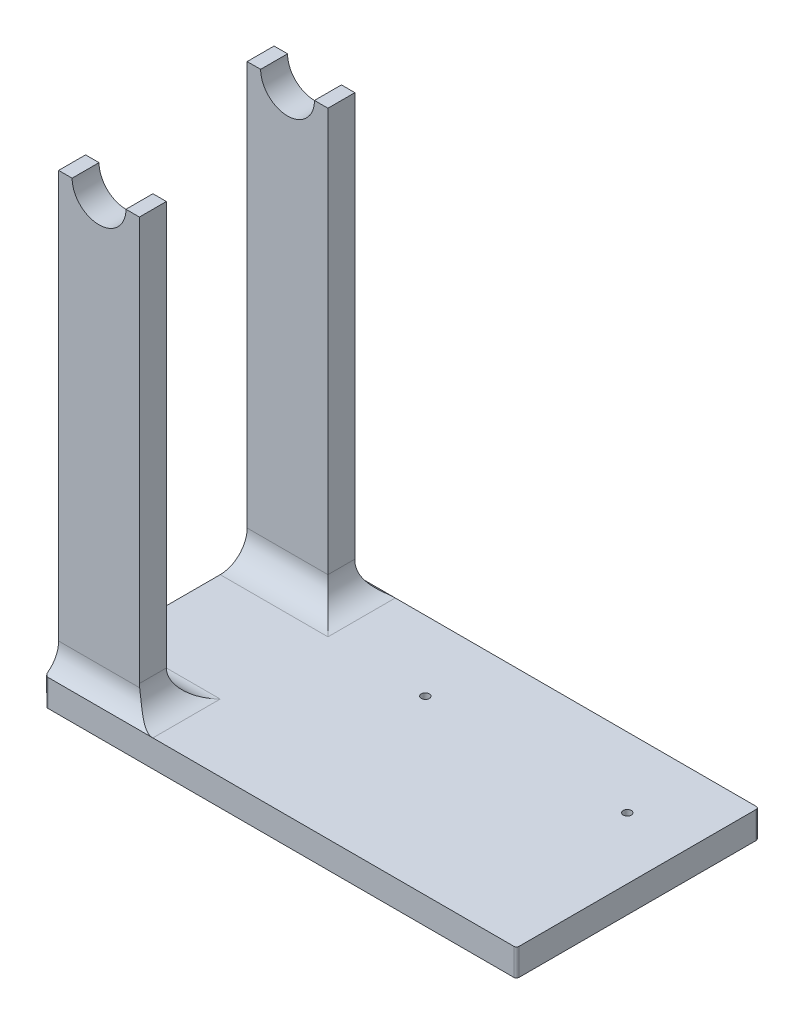
ISO-10303-21;
HEADER;
FILE_DESCRIPTION(('STEP AP214'),'2;1');
FILE_NAME('part.step','',(''),(''),'','','');
FILE_SCHEMA(('AUTOMOTIVE_DESIGN { 1 0 10303 214 1 1 1 1 }'));
ENDSEC;
DATA;
#1=APPLICATION_CONTEXT('core data for automotive mechanical design processes');
#2=APPLICATION_PROTOCOL_DEFINITION('international standard','automotive_design',2000,#1);
#3=PRODUCT_CONTEXT('',#1,'mechanical');
#4=PRODUCT('Part','Part','',(#3));
#5=PRODUCT_RELATED_PRODUCT_CATEGORY('part','',(#4));
#6=PRODUCT_DEFINITION_FORMATION('','',#4);
#7=PRODUCT_DEFINITION_CONTEXT('part definition',#1,'design');
#8=PRODUCT_DEFINITION('design','',#6,#7);
#9=PRODUCT_DEFINITION_SHAPE('','',#8);
#10=(LENGTH_UNIT() NAMED_UNIT(*) SI_UNIT(.MILLI.,.METRE.));
#11=(NAMED_UNIT(*) PLANE_ANGLE_UNIT() SI_UNIT($,.RADIAN.));
#12=(NAMED_UNIT(*) SI_UNIT($,.STERADIAN.) SOLID_ANGLE_UNIT());
#13=UNCERTAINTY_MEASURE_WITH_UNIT(LENGTH_MEASURE(1.E-05),#10,'distance_accuracy_value','');
#14=(GEOMETRIC_REPRESENTATION_CONTEXT(3) GLOBAL_UNCERTAINTY_ASSIGNED_CONTEXT((#13)) GLOBAL_UNIT_ASSIGNED_CONTEXT((#10,
#11,#12)) REPRESENTATION_CONTEXT('',''));
#15=CARTESIAN_POINT('',(0.,0.,0.));
#16=DIRECTION('',(0.,0.,1.));
#17=DIRECTION('',(1.,0.,0.));
#18=AXIS2_PLACEMENT_3D('',#15,#16,#17);
#19=CARTESIAN_POINT('',(0.,10.,0.));
#20=DIRECTION('',(0.,1.,0.));
#21=DIRECTION('',(0.,0.,1.));
#22=AXIS2_PLACEMENT_3D('',#19,#20,#21);
#23=PLANE('',#22);
#24=CARTESIAN_POINT('',(64.65,10.,-19.));
#25=DIRECTION('',(0.,1.,0.));
#26=DIRECTION('',(0.,0.,1.));
#27=AXIS2_PLACEMENT_3D('',#24,#25,#26);
#28=CIRCLE('',#27,1.5);
#29=CARTESIAN_POINT('',(64.65,10.,-17.5));
#30=VERTEX_POINT('',#29);
#31=EDGE_CURVE('E576',#30,#30,#28,.T.);
#32=ORIENTED_EDGE('',*,*,#31,.F.);
#33=EDGE_LOOP('',(#32));
#34=FACE_BOUND('',#33,.T.);
#35=CARTESIAN_POINT('',(-10.35,10.,-19.));
#36=DIRECTION('',(0.,1.,0.));
#37=DIRECTION('',(0.,0.,1.));
#38=AXIS2_PLACEMENT_3D('',#35,#36,#37);
#39=CIRCLE('',#38,1.5);
#40=CARTESIAN_POINT('',(-10.35,10.,-17.5));
#41=VERTEX_POINT('',#40);
#42=EDGE_CURVE('E572',#41,#41,#39,.T.);
#43=ORIENTED_EDGE('',*,*,#42,.F.);
#44=EDGE_LOOP('',(#43));
#45=FACE_BOUND('',#44,.T.);
#46=DIRECTION('',(-1.,0.,0.));
#47=VECTOR('',#46,1.);
#48=CARTESIAN_POINT('',(87.5,10.,-45.));
#49=LINE('',#48,#47);
#50=CARTESIAN_POINT('',(86.5,10.,-45.));
#51=VERTEX_POINT('',#50);
#52=CARTESIAN_POINT('',(-47.5,10.,-45.));
#53=VERTEX_POINT('',#52);
#54=EDGE_CURVE('E344',#51,#53,#49,.T.);
#55=ORIENTED_EDGE('',*,*,#54,.T.);
#56=DIRECTION('',(0.,0.,1.));
#57=VECTOR('',#56,1.);
#58=CARTESIAN_POINT('',(-47.5,10.,0.));
#59=LINE('',#58,#57);
#60=CARTESIAN_POINT('',(-47.5,10.,-20.));
#61=VERTEX_POINT('',#60);
#62=EDGE_CURVE('E394',#53,#61,#59,.T.);
#63=ORIENTED_EDGE('',*,*,#62,.T.);
#64=DIRECTION('',(1.,0.,0.));
#65=VECTOR('',#64,1.);
#66=CARTESIAN_POINT('',(-87.5,10.,-20.));
#67=LINE('',#66,#65);
#68=CARTESIAN_POINT('',(-87.5,10.,-20.));
#69=VERTEX_POINT('',#68);
#70=EDGE_CURVE('E392',#61,#69,#67,.F.);
#71=ORIENTED_EDGE('',*,*,#70,.T.);
#72=DIRECTION('',(0.,0.,1.));
#73=VECTOR('',#72,1.);
#74=CARTESIAN_POINT('',(-87.5,10.,45.));
#75=LINE('',#74,#73);
#76=CARTESIAN_POINT('',(-87.5,10.,20.));
#77=VERTEX_POINT('',#76);
#78=EDGE_CURVE('E332',#69,#77,#75,.T.);
#79=ORIENTED_EDGE('',*,*,#78,.T.);
#80=DIRECTION('',(1.,0.,0.));
#81=VECTOR('',#80,1.);
#82=CARTESIAN_POINT('',(-57.5,10.,20.));
#83=LINE('',#82,#81);
#84=CARTESIAN_POINT('',(-47.5,10.,20.));
#85=VERTEX_POINT('',#84);
#86=EDGE_CURVE('E389',#77,#85,#83,.T.);
#87=ORIENTED_EDGE('',*,*,#86,.T.);
#88=DIRECTION('',(0.,0.,-1.));
#89=VECTOR('',#88,1.);
#90=CARTESIAN_POINT('',(-47.5,10.,0.));
#91=LINE('',#90,#89);
#92=CARTESIAN_POINT('',(-47.5,10.,45.));
#93=VERTEX_POINT('',#92);
#94=EDGE_CURVE('E387',#85,#93,#91,.F.);
#95=ORIENTED_EDGE('',*,*,#94,.T.);
#96=DIRECTION('',(1.,0.,0.));
#97=VECTOR('',#96,1.);
#98=CARTESIAN_POINT('',(87.5,10.,45.));
#99=LINE('',#98,#97);
#100=CARTESIAN_POINT('',(86.5,10.,45.));
#101=VERTEX_POINT('',#100);
#102=EDGE_CURVE('E335',#93,#101,#99,.T.);
#103=ORIENTED_EDGE('',*,*,#102,.T.);
#104=CARTESIAN_POINT('',(86.5,10.,44.));
#105=DIRECTION('',(0.,1.,0.));
#106=DIRECTION('',(0.,0.,1.));
#107=AXIS2_PLACEMENT_3D('',#104,#105,#106);
#108=CIRCLE('',#107,1.);
#109=CARTESIAN_POINT('',(87.5,10.,44.));
#110=VERTEX_POINT('',#109);
#111=EDGE_CURVE('E372',#101,#110,#108,.T.);
#112=ORIENTED_EDGE('',*,*,#111,.T.);
#113=DIRECTION('',(0.,0.,-1.));
#114=VECTOR('',#113,1.);
#115=CARTESIAN_POINT('',(87.5,10.,45.));
#116=LINE('',#115,#114);
#117=CARTESIAN_POINT('',(87.5,10.,-44.));
#118=VERTEX_POINT('',#117);
#119=EDGE_CURVE('E340',#110,#118,#116,.T.);
#120=ORIENTED_EDGE('',*,*,#119,.T.);
#121=CARTESIAN_POINT('',(86.5,10.,-44.));
#122=DIRECTION('',(0.,1.,0.));
#123=DIRECTION('',(0.,0.,1.));
#124=AXIS2_PLACEMENT_3D('',#121,#122,#123);
#125=CIRCLE('',#124,1.);
#126=EDGE_CURVE('E374',#118,#51,#125,.T.);
#127=ORIENTED_EDGE('',*,*,#126,.T.);
#128=EDGE_LOOP('',(#55,#63,#71,#79,#87,#95,#103,#112,#120,#127));
#129=FACE_BOUND('',#128,.T.);
#130=ADVANCED_FACE('F69',(#34,#45,#129),#23,.T.);
#131=CARTESIAN_POINT('',(-87.5,10.,45.));
#132=DIRECTION('',(1.,0.,0.));
#133=DIRECTION('',(0.,0.,-1.));
#134=AXIS2_PLACEMENT_3D('',#131,#132,#133);
#135=PLANE('',#134);
#136=DIRECTION('',(0.,-1.,0.));
#137=VECTOR('',#136,1.);
#138=CARTESIAN_POINT('',(-87.5,160.,-40.));
#139=LINE('',#138,#137);
#140=CARTESIAN_POINT('',(-87.5,170.,-40.));
#141=VERTEX_POINT('',#140);
#142=CARTESIAN_POINT('',(-87.5,18.6602540378444,-40.));
#143=VERTEX_POINT('',#142);
#144=EDGE_CURVE('E282',#141,#143,#139,.T.);
#145=ORIENTED_EDGE('',*,*,#144,.T.);
#146=CARTESIAN_POINT('',(-87.5,18.6602540378444,-50.));
#147=DIRECTION('',(1.,0.,0.));
#148=DIRECTION('',(0.,0.,-1.));
#149=AXIS2_PLACEMENT_3D('',#146,#147,#148);
#150=CIRCLE('',#149,10.);
#151=CARTESIAN_POINT('',(-87.5,10.6602540378444,-44.));
#152=VERTEX_POINT('',#151);
#153=EDGE_CURVE('E407',#143,#152,#150,.T.);
#154=ORIENTED_EDGE('',*,*,#153,.T.);
#155=DIRECTION('',(0.,-1.,0.));
#156=VECTOR('',#155,1.);
#157=CARTESIAN_POINT('',(-87.5,10.,-44.));
#158=LINE('',#157,#156);
#159=CARTESIAN_POINT('',(-87.5,0.,-44.));
#160=VERTEX_POINT('',#159);
#161=EDGE_CURVE('E98',#152,#160,#158,.T.);
#162=ORIENTED_EDGE('',*,*,#161,.T.);
#163=DIRECTION('',(0.,0.,1.));
#164=VECTOR('',#163,1.);
#165=CARTESIAN_POINT('',(-87.5,0.,45.));
#166=LINE('',#165,#164);
#167=CARTESIAN_POINT('',(-87.5,0.,44.));
#168=VERTEX_POINT('',#167);
#169=EDGE_CURVE('E331',#160,#168,#166,.T.);
#170=ORIENTED_EDGE('',*,*,#169,.T.);
#171=DIRECTION('',(0.,-1.,0.));
#172=VECTOR('',#171,1.);
#173=CARTESIAN_POINT('',(-87.5,10.,44.));
#174=LINE('',#173,#172);
#175=CARTESIAN_POINT('',(-87.5,10.6602540378444,44.));
#176=VERTEX_POINT('',#175);
#177=EDGE_CURVE('E90',#168,#176,#174,.F.);
#178=ORIENTED_EDGE('',*,*,#177,.T.);
#179=CARTESIAN_POINT('',(-87.5,18.6602540378444,50.));
#180=DIRECTION('',(1.,0.,0.));
#181=DIRECTION('',(0.,0.,-1.));
#182=AXIS2_PLACEMENT_3D('',#179,#180,#181);
#183=CIRCLE('',#182,10.);
#184=CARTESIAN_POINT('',(-87.5,18.6602540378444,40.));
#185=VERTEX_POINT('',#184);
#186=EDGE_CURVE('E12',#176,#185,#183,.T.);
#187=ORIENTED_EDGE('',*,*,#186,.T.);
#188=DIRECTION('',(0.,-1.,0.));
#189=VECTOR('',#188,1.);
#190=CARTESIAN_POINT('',(-87.5,160.,40.));
#191=LINE('',#190,#189);
#192=CARTESIAN_POINT('',(-87.5,170.,40.));
#193=VERTEX_POINT('',#192);
#194=EDGE_CURVE('E314',#193,#185,#191,.T.);
#195=ORIENTED_EDGE('',*,*,#194,.F.);
#196=DIRECTION('',(0.,0.,1.));
#197=VECTOR('',#196,1.);
#198=CARTESIAN_POINT('',(-87.5,170.,11.97224362268));
#199=LINE('',#198,#197);
#200=CARTESIAN_POINT('',(-87.5,170.,30.));
#201=VERTEX_POINT('',#200);
#202=EDGE_CURVE('E309',#201,#193,#199,.T.);
#203=ORIENTED_EDGE('',*,*,#202,.F.);
#204=DIRECTION('',(0.,-1.,0.));
#205=VECTOR('',#204,1.);
#206=CARTESIAN_POINT('',(-87.5,160.,30.));
#207=LINE('',#206,#205);
#208=CARTESIAN_POINT('',(-87.5,20.,30.));
#209=VERTEX_POINT('',#208);
#210=EDGE_CURVE('E322',#201,#209,#207,.T.);
#211=ORIENTED_EDGE('',*,*,#210,.T.);
#212=CARTESIAN_POINT('',(-87.5,20.,20.));
#213=DIRECTION('',(1.,0.,0.));
#214=DIRECTION('',(0.,0.,-1.));
#215=AXIS2_PLACEMENT_3D('',#212,#213,#214);
#216=CIRCLE('',#215,10.);
#217=EDGE_CURVE('E532',#209,#77,#216,.T.);
#218=ORIENTED_EDGE('',*,*,#217,.T.);
#219=ORIENTED_EDGE('',*,*,#78,.F.);
#220=CARTESIAN_POINT('',(-87.5,20.,-20.));
#221=DIRECTION('',(1.,0.,0.));
#222=DIRECTION('',(0.,0.,-1.));
#223=AXIS2_PLACEMENT_3D('',#220,#221,#222);
#224=CIRCLE('',#223,10.);
#225=CARTESIAN_POINT('',(-87.5,20.,-30.));
#226=VERTEX_POINT('',#225);
#227=EDGE_CURVE('E530',#69,#226,#224,.T.);
#228=ORIENTED_EDGE('',*,*,#227,.T.);
#229=DIRECTION('',(0.,-1.,0.));
#230=VECTOR('',#229,1.);
#231=CARTESIAN_POINT('',(-87.5,160.,-30.));
#232=LINE('',#231,#230);
#233=CARTESIAN_POINT('',(-87.5,170.,-30.));
#234=VERTEX_POINT('',#233);
#235=EDGE_CURVE('E257',#234,#226,#232,.T.);
#236=ORIENTED_EDGE('',*,*,#235,.F.);
#237=DIRECTION('',(0.,0.,-1.));
#238=VECTOR('',#237,1.);
#239=CARTESIAN_POINT('',(-87.5,170.,-11.97224362268));
#240=LINE('',#239,#238);
#241=EDGE_CURVE('E276',#234,#141,#240,.T.);
#242=ORIENTED_EDGE('',*,*,#241,.T.);
#243=EDGE_LOOP('',(#145,#154,#162,#170,#178,#187,#195,#203,#211,#218,#219,#228,#236,#242));
#244=FACE_BOUND('',#243,.T.);
#245=ADVANCED_FACE('F430',(#244),#135,.F.);
#246=CARTESIAN_POINT('',(87.5,10.,45.));
#247=DIRECTION('',(0.,0.,-1.));
#248=DIRECTION('',(-1.,0.,0.));
#249=AXIS2_PLACEMENT_3D('',#246,#247,#248);
#250=PLANE('',#249);
#251=DIRECTION('',(1.,0.,0.));
#252=VECTOR('',#251,1.);
#253=CARTESIAN_POINT('',(87.5,0.,45.));
#254=LINE('',#253,#252);
#255=CARTESIAN_POINT('',(-86.5,0.,45.));
#256=VERTEX_POINT('',#255);
#257=CARTESIAN_POINT('',(86.5,0.,45.));
#258=VERTEX_POINT('',#257);
#259=EDGE_CURVE('E348',#256,#258,#254,.T.);
#260=ORIENTED_EDGE('',*,*,#259,.T.);
#261=DIRECTION('',(0.,-1.,0.));
#262=VECTOR('',#261,1.);
#263=CARTESIAN_POINT('',(86.5,10.,45.));
#264=LINE('',#263,#262);
#265=EDGE_CURVE('E384',#258,#101,#264,.F.);
#266=ORIENTED_EDGE('',*,*,#265,.T.);
#267=ORIENTED_EDGE('',*,*,#102,.F.);
#268=CARTESIAN_POINT('',(-86.5,10.,45.));
#269=VERTEX_POINT('',#268);
#270=EDGE_CURVE('E337',#269,#93,#99,.T.);
#271=ORIENTED_EDGE('',*,*,#270,.F.);
#272=DIRECTION('',(0.,-1.,0.));
#273=VECTOR('',#272,1.);
#274=CARTESIAN_POINT('',(-86.5,10.,45.));
#275=LINE('',#274,#273);
#276=EDGE_CURVE('E381',#269,#256,#275,.T.);
#277=ORIENTED_EDGE('',*,*,#276,.T.);
#278=EDGE_LOOP('',(#260,#266,#267,#271,#277));
#279=FACE_BOUND('',#278,.T.);
#280=ADVANCED_FACE('F477',(#279),#250,.F.);
#281=CARTESIAN_POINT('',(87.5,10.,45.));
#282=DIRECTION('',(-1.,0.,0.));
#283=DIRECTION('',(0.,0.,1.));
#284=AXIS2_PLACEMENT_3D('',#281,#282,#283);
#285=PLANE('',#284);
#286=DIRECTION('',(0.,0.,-1.));
#287=VECTOR('',#286,1.);
#288=CARTESIAN_POINT('',(87.5,0.,45.));
#289=LINE('',#288,#287);
#290=CARTESIAN_POINT('',(87.5,0.,44.));
#291=VERTEX_POINT('',#290);
#292=CARTESIAN_POINT('',(87.5,0.,-44.));
#293=VERTEX_POINT('',#292);
#294=EDGE_CURVE('E351',#291,#293,#289,.T.);
#295=ORIENTED_EDGE('',*,*,#294,.T.);
#296=DIRECTION('',(0.,-1.,0.));
#297=VECTOR('',#296,1.);
#298=CARTESIAN_POINT('',(87.5,10.,-44.));
#299=LINE('',#298,#297);
#300=EDGE_CURVE('E379',#293,#118,#299,.F.);
#301=ORIENTED_EDGE('',*,*,#300,.T.);
#302=ORIENTED_EDGE('',*,*,#119,.F.);
#303=DIRECTION('',(0.,-1.,0.));
#304=VECTOR('',#303,1.);
#305=CARTESIAN_POINT('',(87.5,10.,44.));
#306=LINE('',#305,#304);
#307=EDGE_CURVE('E376',#110,#291,#306,.T.);
#308=ORIENTED_EDGE('',*,*,#307,.T.);
#309=EDGE_LOOP('',(#295,#301,#302,#308));
#310=FACE_BOUND('',#309,.T.);
#311=ADVANCED_FACE('F491',(#310),#285,.F.);
#312=CARTESIAN_POINT('',(87.5,10.,-45.));
#313=DIRECTION('',(0.,0.,1.));
#314=DIRECTION('',(1.,0.,0.));
#315=AXIS2_PLACEMENT_3D('',#312,#313,#314);
#316=PLANE('',#315);
#317=DIRECTION('',(-1.,0.,0.));
#318=VECTOR('',#317,1.);
#319=CARTESIAN_POINT('',(87.5,0.,-45.));
#320=LINE('',#319,#318);
#321=CARTESIAN_POINT('',(86.5,0.,-45.));
#322=VERTEX_POINT('',#321);
#323=CARTESIAN_POINT('',(-86.5,0.,-45.));
#324=VERTEX_POINT('',#323);
#325=EDGE_CURVE('E336',#322,#324,#320,.T.);
#326=ORIENTED_EDGE('',*,*,#325,.T.);
#327=DIRECTION('',(0.,-1.,0.));
#328=VECTOR('',#327,1.);
#329=CARTESIAN_POINT('',(-86.5,10.,-45.));
#330=LINE('',#329,#328);
#331=CARTESIAN_POINT('',(-86.5,10.,-45.));
#332=VERTEX_POINT('',#331);
#333=EDGE_CURVE('E369',#324,#332,#330,.F.);
#334=ORIENTED_EDGE('',*,*,#333,.T.);
#335=EDGE_CURVE('E343',#53,#332,#49,.T.);
#336=ORIENTED_EDGE('',*,*,#335,.F.);
#337=ORIENTED_EDGE('',*,*,#54,.F.);
#338=DIRECTION('',(0.,-1.,0.));
#339=VECTOR('',#338,1.);
#340=CARTESIAN_POINT('',(86.5,10.,-45.));
#341=LINE('',#340,#339);
#342=EDGE_CURVE('E366',#51,#322,#341,.T.);
#343=ORIENTED_EDGE('',*,*,#342,.T.);
#344=EDGE_LOOP('',(#326,#334,#336,#337,#343));
#345=FACE_BOUND('',#344,.T.);
#346=ADVANCED_FACE('F487',(#345),#316,.F.);
#347=CARTESIAN_POINT('',(0.,0.,0.));
#348=DIRECTION('',(0.,1.,0.));
#349=DIRECTION('',(0.,0.,1.));
#350=AXIS2_PLACEMENT_3D('',#347,#348,#349);
#351=PLANE('',#350);
#352=CARTESIAN_POINT('',(64.65,0.,-19.));
#353=DIRECTION('',(0.,1.,0.));
#354=DIRECTION('',(0.,0.,1.));
#355=AXIS2_PLACEMENT_3D('',#352,#353,#354);
#356=CIRCLE('',#355,1.5);
#357=CARTESIAN_POINT('',(64.65,0.,-17.5));
#358=VERTEX_POINT('',#357);
#359=EDGE_CURVE('E264',#358,#358,#356,.T.);
#360=ORIENTED_EDGE('',*,*,#359,.T.);
#361=EDGE_LOOP('',(#360));
#362=FACE_BOUND('',#361,.T.);
#363=CARTESIAN_POINT('',(-10.35,0.,-19.));
#364=DIRECTION('',(0.,1.,0.));
#365=DIRECTION('',(0.,0.,1.));
#366=AXIS2_PLACEMENT_3D('',#363,#364,#365);
#367=CIRCLE('',#366,1.5);
#368=CARTESIAN_POINT('',(-10.35,0.,-17.5));
#369=VERTEX_POINT('',#368);
#370=EDGE_CURVE('E268',#369,#369,#367,.T.);
#371=ORIENTED_EDGE('',*,*,#370,.T.);
#372=EDGE_LOOP('',(#371));
#373=FACE_BOUND('',#372,.T.);
#374=ORIENTED_EDGE('',*,*,#169,.F.);
#375=CARTESIAN_POINT('',(-86.5,0.,-44.));
#376=DIRECTION('',(0.,1.,0.));
#377=DIRECTION('',(0.,0.,1.));
#378=AXIS2_PLACEMENT_3D('',#375,#376,#377);
#379=CIRCLE('',#378,1.);
#380=EDGE_CURVE('E364',#160,#324,#379,.F.);
#381=ORIENTED_EDGE('',*,*,#380,.T.);
#382=ORIENTED_EDGE('',*,*,#325,.F.);
#383=CARTESIAN_POINT('',(86.5,0.,-44.));
#384=DIRECTION('',(0.,1.,0.));
#385=DIRECTION('',(0.,0.,1.));
#386=AXIS2_PLACEMENT_3D('',#383,#384,#385);
#387=CIRCLE('',#386,1.);
#388=EDGE_CURVE('E362',#322,#293,#387,.F.);
#389=ORIENTED_EDGE('',*,*,#388,.T.);
#390=ORIENTED_EDGE('',*,*,#294,.F.);
#391=CARTESIAN_POINT('',(86.5,0.,44.));
#392=DIRECTION('',(0.,1.,0.));
#393=DIRECTION('',(0.,0.,1.));
#394=AXIS2_PLACEMENT_3D('',#391,#392,#393);
#395=CIRCLE('',#394,1.);
#396=EDGE_CURVE('E360',#291,#258,#395,.F.);
#397=ORIENTED_EDGE('',*,*,#396,.T.);
#398=ORIENTED_EDGE('',*,*,#259,.F.);
#399=CARTESIAN_POINT('',(-86.5,0.,44.));
#400=DIRECTION('',(0.,1.,0.));
#401=DIRECTION('',(0.,0.,1.));
#402=AXIS2_PLACEMENT_3D('',#399,#400,#401);
#403=CIRCLE('',#402,1.);
#404=EDGE_CURVE('E358',#256,#168,#403,.F.);
#405=ORIENTED_EDGE('',*,*,#404,.T.);
#406=EDGE_LOOP('',(#374,#381,#382,#389,#390,#397,#398,#405));
#407=FACE_BOUND('',#406,.T.);
#408=ADVANCED_FACE('F484',(#362,#373,#407),#351,.F.);
#409=CARTESIAN_POINT('',(0.,160.,40.));
#410=DIRECTION('',(0.,0.,-1.));
#411=DIRECTION('',(-1.,0.,0.));
#412=AXIS2_PLACEMENT_3D('',#409,#410,#411);
#413=PLANE('',#412);
#414=ORIENTED_EDGE('',*,*,#194,.T.);
#415=DIRECTION('',(-1.,0.,0.));
#416=VECTOR('',#415,1.);
#417=CARTESIAN_POINT('',(0.,18.6602540378444,40.));
#418=LINE('',#417,#416);
#419=CARTESIAN_POINT('',(-57.4098476656752,18.6602540378444,40.));
#420=VERTEX_POINT('',#419);
#421=EDGE_CURVE('E405',#185,#420,#418,.F.);
#422=ORIENTED_EDGE('',*,*,#421,.T.);
#423=CARTESIAN_POINT('',(-47.5,20.,40.));
#424=DIRECTION('',(0.,0.,-1.));
#425=DIRECTION('',(-1.,0.,0.));
#426=AXIS2_PLACEMENT_3D('',#423,#424,#425);
#427=CIRCLE('',#426,10.);
#428=CARTESIAN_POINT('',(-57.5,20.,40.));
#429=VERTEX_POINT('',#428);
#430=EDGE_CURVE('E452',#420,#429,#427,.T.);
#431=ORIENTED_EDGE('',*,*,#430,.T.);
#432=DIRECTION('',(0.,-1.,0.));
#433=VECTOR('',#432,1.);
#434=CARTESIAN_POINT('',(-57.5,160.,40.));
#435=LINE('',#434,#433);
#436=CARTESIAN_POINT('',(-57.5,170.,40.));
#437=VERTEX_POINT('',#436);
#438=EDGE_CURVE('E328',#437,#429,#435,.T.);
#439=ORIENTED_EDGE('',*,*,#438,.F.);
#440=DIRECTION('',(-1.,0.,0.));
#441=VECTOR('',#440,1.);
#442=CARTESIAN_POINT('',(9.43689570931383E-13,170.,40.));
#443=LINE('',#442,#441);
#444=CARTESIAN_POINT('',(-62.5,170.,40.));
#445=VERTEX_POINT('',#444);
#446=EDGE_CURVE('E292',#437,#445,#443,.T.);
#447=ORIENTED_EDGE('',*,*,#446,.T.);
#448=CARTESIAN_POINT('',(-72.5,170.,40.));
#449=DIRECTION('',(0.,0.,1.));
#450=DIRECTION('',(1.,0.,0.));
#451=AXIS2_PLACEMENT_3D('',#448,#449,#450);
#452=CIRCLE('',#451,10.);
#453=CARTESIAN_POINT('',(-82.5,170.,40.));
#454=VERTEX_POINT('',#453);
#455=EDGE_CURVE('E310',#454,#445,#452,.T.);
#456=ORIENTED_EDGE('',*,*,#455,.F.);
#457=DIRECTION('',(1.,0.,0.));
#458=VECTOR('',#457,1.);
#459=CARTESIAN_POINT('',(-9.43689570931388E-13,170.000000000001,40.));
#460=LINE('',#459,#458);
#461=EDGE_CURVE('E305',#193,#454,#460,.T.);
#462=ORIENTED_EDGE('',*,*,#461,.F.);
#463=EDGE_LOOP('',(#414,#422,#431,#439,#447,#456,#462));
#464=FACE_BOUND('',#463,.T.);
#465=ADVANCED_FACE('F482',(#464),#413,.F.);
#466=CARTESIAN_POINT('',(-57.5,160.,0.));
#467=DIRECTION('',(-1.,0.,0.));
#468=DIRECTION('',(0.,0.,1.));
#469=AXIS2_PLACEMENT_3D('',#466,#467,#468);
#470=PLANE('',#469);
#471=ORIENTED_EDGE('',*,*,#438,.T.);
#472=DIRECTION('',(0.,0.,-1.));
#473=VECTOR('',#472,1.);
#474=CARTESIAN_POINT('',(-57.5,20.,0.));
#475=LINE('',#474,#473);
#476=CARTESIAN_POINT('',(-57.5,20.,30.));
#477=VERTEX_POINT('',#476);
#478=EDGE_CURVE('E403',#429,#477,#475,.T.);
#479=ORIENTED_EDGE('',*,*,#478,.T.);
#480=DIRECTION('',(0.,-1.,0.));
#481=VECTOR('',#480,1.);
#482=CARTESIAN_POINT('',(-57.5,160.,30.));
#483=LINE('',#482,#481);
#484=CARTESIAN_POINT('',(-57.5,170.,30.));
#485=VERTEX_POINT('',#484);
#486=EDGE_CURVE('E325',#485,#477,#483,.T.);
#487=ORIENTED_EDGE('',*,*,#486,.F.);
#488=DIRECTION('',(0.,0.,1.));
#489=VECTOR('',#488,1.);
#490=CARTESIAN_POINT('',(-57.5,170.,11.97224362268));
#491=LINE('',#490,#489);
#492=EDGE_CURVE('E293',#485,#437,#491,.T.);
#493=ORIENTED_EDGE('',*,*,#492,.T.);
#494=EDGE_LOOP('',(#471,#479,#487,#493));
#495=FACE_BOUND('',#494,.T.);
#496=ADVANCED_FACE('F619',(#495),#470,.F.);
#497=CARTESIAN_POINT('',(0.,160.,30.));
#498=DIRECTION('',(0.,0.,-1.));
#499=DIRECTION('',(-1.,0.,0.));
#500=AXIS2_PLACEMENT_3D('',#497,#498,#499);
#501=PLANE('',#500);
#502=ORIENTED_EDGE('',*,*,#486,.T.);
#503=DIRECTION('',(1.,0.,0.));
#504=VECTOR('',#503,1.);
#505=CARTESIAN_POINT('',(-87.5,20.,30.));
#506=LINE('',#505,#504);
#507=EDGE_CURVE('E401',#477,#209,#506,.F.);
#508=ORIENTED_EDGE('',*,*,#507,.T.);
#509=ORIENTED_EDGE('',*,*,#210,.F.);
#510=DIRECTION('',(1.,0.,0.));
#511=VECTOR('',#510,1.);
#512=CARTESIAN_POINT('',(-9.43689570931388E-13,170.000000000001,30.));
#513=LINE('',#512,#511);
#514=CARTESIAN_POINT('',(-82.5,170.,30.));
#515=VERTEX_POINT('',#514);
#516=EDGE_CURVE('E308',#201,#515,#513,.T.);
#517=ORIENTED_EDGE('',*,*,#516,.T.);
#518=CARTESIAN_POINT('',(-72.5,170.,30.));
#519=DIRECTION('',(0.,0.,-1.));
#520=DIRECTION('',(-1.,0.,0.));
#521=AXIS2_PLACEMENT_3D('',#518,#519,#520);
#522=CIRCLE('',#521,10.);
#523=CARTESIAN_POINT('',(-62.5,170.,30.));
#524=VERTEX_POINT('',#523);
#525=EDGE_CURVE('E312',#515,#524,#522,.F.);
#526=ORIENTED_EDGE('',*,*,#525,.T.);
#527=DIRECTION('',(-1.,0.,0.));
#528=VECTOR('',#527,1.);
#529=CARTESIAN_POINT('',(9.43689570931383E-13,170.,30.));
#530=LINE('',#529,#528);
#531=EDGE_CURVE('E296',#485,#524,#530,.T.);
#532=ORIENTED_EDGE('',*,*,#531,.F.);
#533=EDGE_LOOP('',(#502,#508,#509,#517,#526,#532));
#534=FACE_BOUND('',#533,.T.);
#535=ADVANCED_FACE('F616',(#534),#501,.T.);
#536=CARTESIAN_POINT('',(-72.5,170.,11.97224362268));
#537=DIRECTION('',(0.,0.,1.));
#538=DIRECTION('',(1.,0.,0.));
#539=AXIS2_PLACEMENT_3D('',#536,#537,#538);
#540=CYLINDRICAL_SURFACE('',#539,10.);
#541=ORIENTED_EDGE('',*,*,#525,.F.);
#542=DIRECTION('',(0.,0.,1.));
#543=VECTOR('',#542,1.);
#544=CARTESIAN_POINT('',(-82.5,170.,11.97224362268));
#545=LINE('',#544,#543);
#546=EDGE_CURVE('E300',#515,#454,#545,.T.);
#547=ORIENTED_EDGE('',*,*,#546,.T.);
#548=ORIENTED_EDGE('',*,*,#455,.T.);
#549=DIRECTION('',(0.,0.,1.));
#550=VECTOR('',#549,1.);
#551=CARTESIAN_POINT('',(-62.5,170.,11.97224362268));
#552=LINE('',#551,#550);
#553=EDGE_CURVE('E297',#524,#445,#552,.T.);
#554=ORIENTED_EDGE('',*,*,#553,.F.);
#555=EDGE_LOOP('',(#541,#547,#548,#554));
#556=FACE_BOUND('',#555,.T.);
#557=ADVANCED_FACE('F613',(#556),#540,.F.);
#558=CARTESIAN_POINT('',(-9.43689570931388E-13,170.000000000001,11.97224362268));
#559=DIRECTION('',(0.,-1.,0.));
#560=DIRECTION('',(1.,0.,0.));
#561=AXIS2_PLACEMENT_3D('',#558,#559,#560);
#562=PLANE('',#561);
#563=ORIENTED_EDGE('',*,*,#516,.F.);
#564=ORIENTED_EDGE('',*,*,#202,.T.);
#565=ORIENTED_EDGE('',*,*,#461,.T.);
#566=ORIENTED_EDGE('',*,*,#546,.F.);
#567=EDGE_LOOP('',(#563,#564,#565,#566));
#568=FACE_BOUND('',#567,.T.);
#569=ADVANCED_FACE('F553',(#568),#562,.F.);
#570=CARTESIAN_POINT('',(9.43689570931383E-13,170.,11.97224362268));
#571=DIRECTION('',(0.,1.,0.));
#572=DIRECTION('',(-1.,0.,0.));
#573=AXIS2_PLACEMENT_3D('',#570,#571,#572);
#574=PLANE('',#573);
#575=ORIENTED_EDGE('',*,*,#492,.F.);
#576=ORIENTED_EDGE('',*,*,#531,.T.);
#577=ORIENTED_EDGE('',*,*,#553,.T.);
#578=ORIENTED_EDGE('',*,*,#446,.F.);
#579=EDGE_LOOP('',(#575,#576,#577,#578));
#580=FACE_BOUND('',#579,.T.);
#581=ADVANCED_FACE('F607',(#580),#574,.T.);
#582=CARTESIAN_POINT('',(0.,160.,-40.));
#583=DIRECTION('',(0.,0.,1.));
#584=DIRECTION('',(-1.,0.,0.));
#585=AXIS2_PLACEMENT_3D('',#582,#583,#584);
#586=PLANE('',#585);
#587=DIRECTION('',(0.,-1.,0.));
#588=VECTOR('',#587,1.);
#589=CARTESIAN_POINT('',(-57.5,160.,-40.));
#590=LINE('',#589,#588);
#591=CARTESIAN_POINT('',(-57.5,170.,-40.));
#592=VERTEX_POINT('',#591);
#593=CARTESIAN_POINT('',(-57.5,20.,-40.));
#594=VERTEX_POINT('',#593);
#595=EDGE_CURVE('E256',#592,#594,#590,.T.);
#596=ORIENTED_EDGE('',*,*,#595,.T.);
#597=CARTESIAN_POINT('',(-47.5,20.,-40.));
#598=DIRECTION('',(0.,0.,1.));
#599=DIRECTION('',(1.,0.,0.));
#600=AXIS2_PLACEMENT_3D('',#597,#598,#599);
#601=CIRCLE('',#600,10.);
#602=CARTESIAN_POINT('',(-57.4098476656752,18.6602540378444,-40.));
#603=VERTEX_POINT('',#602);
#604=EDGE_CURVE('E417',#594,#603,#601,.T.);
#605=ORIENTED_EDGE('',*,*,#604,.T.);
#606=DIRECTION('',(1.,0.,0.));
#607=VECTOR('',#606,1.);
#608=CARTESIAN_POINT('',(0.,18.6602540378444,-40.));
#609=LINE('',#608,#607);
#610=EDGE_CURVE('E396',#603,#143,#609,.F.);
#611=ORIENTED_EDGE('',*,*,#610,.T.);
#612=ORIENTED_EDGE('',*,*,#144,.F.);
#613=DIRECTION('',(1.,0.,0.));
#614=VECTOR('',#613,1.);
#615=CARTESIAN_POINT('',(-9.43689570931388E-13,170.000000000001,-40.));
#616=LINE('',#615,#614);
#617=CARTESIAN_POINT('',(-82.5,170.,-40.));
#618=VERTEX_POINT('',#617);
#619=EDGE_CURVE('E272',#141,#618,#616,.T.);
#620=ORIENTED_EDGE('',*,*,#619,.T.);
#621=CARTESIAN_POINT('',(-72.5,170.,-40.));
#622=DIRECTION('',(0.,0.,1.));
#623=DIRECTION('',(1.,0.,0.));
#624=AXIS2_PLACEMENT_3D('',#621,#622,#623);
#625=CIRCLE('',#624,10.);
#626=CARTESIAN_POINT('',(-62.5,170.,-40.));
#627=VERTEX_POINT('',#626);
#628=EDGE_CURVE('E277',#618,#627,#625,.T.);
#629=ORIENTED_EDGE('',*,*,#628,.T.);
#630=DIRECTION('',(-1.,0.,0.));
#631=VECTOR('',#630,1.);
#632=CARTESIAN_POINT('',(9.43689570931383E-13,170.,-40.));
#633=LINE('',#632,#631);
#634=EDGE_CURVE('E262',#592,#627,#633,.T.);
#635=ORIENTED_EDGE('',*,*,#634,.F.);
#636=EDGE_LOOP('',(#596,#605,#611,#612,#620,#629,#635));
#637=FACE_BOUND('',#636,.T.);
#638=ADVANCED_FACE('F534',(#637),#586,.F.);
#639=CARTESIAN_POINT('',(-57.5,160.,0.));
#640=DIRECTION('',(-1.,0.,0.));
#641=DIRECTION('',(0.,0.,-1.));
#642=AXIS2_PLACEMENT_3D('',#639,#640,#641);
#643=PLANE('',#642);
#644=DIRECTION('',(0.,-1.,0.));
#645=VECTOR('',#644,1.);
#646=CARTESIAN_POINT('',(-57.5,160.,-30.));
#647=LINE('',#646,#645);
#648=CARTESIAN_POINT('',(-57.5,170.,-30.));
#649=VERTEX_POINT('',#648);
#650=CARTESIAN_POINT('',(-57.5,20.,-30.));
#651=VERTEX_POINT('',#650);
#652=EDGE_CURVE('E249',#649,#651,#647,.T.);
#653=ORIENTED_EDGE('',*,*,#652,.T.);
#654=DIRECTION('',(0.,0.,1.));
#655=VECTOR('',#654,1.);
#656=CARTESIAN_POINT('',(-57.5,20.,0.));
#657=LINE('',#656,#655);
#658=EDGE_CURVE('E398',#651,#594,#657,.F.);
#659=ORIENTED_EDGE('',*,*,#658,.T.);
#660=ORIENTED_EDGE('',*,*,#595,.F.);
#661=DIRECTION('',(0.,0.,-1.));
#662=VECTOR('',#661,1.);
#663=CARTESIAN_POINT('',(-57.5,170.,-11.97224362268));
#664=LINE('',#663,#662);
#665=EDGE_CURVE('E241',#649,#592,#664,.T.);
#666=ORIENTED_EDGE('',*,*,#665,.F.);
#667=EDGE_LOOP('',(#653,#659,#660,#666));
#668=FACE_BOUND('',#667,.T.);
#669=ADVANCED_FACE('F259',(#668),#643,.F.);
#670=CARTESIAN_POINT('',(0.,160.,-30.));
#671=DIRECTION('',(0.,0.,1.));
#672=DIRECTION('',(-1.,0.,0.));
#673=AXIS2_PLACEMENT_3D('',#670,#671,#672);
#674=PLANE('',#673);
#675=ORIENTED_EDGE('',*,*,#235,.T.);
#676=DIRECTION('',(1.,0.,0.));
#677=VECTOR('',#676,1.);
#678=CARTESIAN_POINT('',(-57.5,20.,-30.));
#679=LINE('',#678,#677);
#680=EDGE_CURVE('E253',#226,#651,#679,.T.);
#681=ORIENTED_EDGE('',*,*,#680,.T.);
#682=ORIENTED_EDGE('',*,*,#652,.F.);
#683=DIRECTION('',(-1.,0.,0.));
#684=VECTOR('',#683,1.);
#685=CARTESIAN_POINT('',(9.43689570931383E-13,170.,-30.));
#686=LINE('',#685,#684);
#687=CARTESIAN_POINT('',(-62.5,170.,-30.));
#688=VERTEX_POINT('',#687);
#689=EDGE_CURVE('E236',#649,#688,#686,.T.);
#690=ORIENTED_EDGE('',*,*,#689,.T.);
#691=CARTESIAN_POINT('',(-72.5,170.,-30.));
#692=DIRECTION('',(0.,0.,-1.));
#693=DIRECTION('',(-1.,0.,0.));
#694=AXIS2_PLACEMENT_3D('',#691,#692,#693);
#695=CIRCLE('',#694,10.);
#696=CARTESIAN_POINT('',(-82.5,170.,-30.));
#697=VERTEX_POINT('',#696);
#698=EDGE_CURVE('E280',#697,#688,#695,.F.);
#699=ORIENTED_EDGE('',*,*,#698,.F.);
#700=DIRECTION('',(1.,0.,0.));
#701=VECTOR('',#700,1.);
#702=CARTESIAN_POINT('',(-9.43689570931388E-13,170.000000000001,-30.));
#703=LINE('',#702,#701);
#704=EDGE_CURVE('E275',#234,#697,#703,.T.);
#705=ORIENTED_EDGE('',*,*,#704,.F.);
#706=EDGE_LOOP('',(#675,#681,#682,#690,#699,#705));
#707=FACE_BOUND('',#706,.T.);
#708=ADVANCED_FACE('F251',(#707),#674,.T.);
#709=CARTESIAN_POINT('',(-72.5,170.,-11.97224362268));
#710=DIRECTION('',(0.,0.,-1.));
#711=DIRECTION('',(1.,0.,0.));
#712=AXIS2_PLACEMENT_3D('',#709,#710,#711);
#713=CYLINDRICAL_SURFACE('',#712,10.);
#714=ORIENTED_EDGE('',*,*,#698,.T.);
#715=DIRECTION('',(0.,0.,-1.));
#716=VECTOR('',#715,1.);
#717=CARTESIAN_POINT('',(-62.5,170.,-11.97224362268));
#718=LINE('',#717,#716);
#719=EDGE_CURVE('E243',#688,#627,#718,.T.);
#720=ORIENTED_EDGE('',*,*,#719,.T.);
#721=ORIENTED_EDGE('',*,*,#628,.F.);
#722=DIRECTION('',(0.,0.,-1.));
#723=VECTOR('',#722,1.);
#724=CARTESIAN_POINT('',(-82.5,170.,-11.97224362268));
#725=LINE('',#724,#723);
#726=EDGE_CURVE('E270',#697,#618,#725,.T.);
#727=ORIENTED_EDGE('',*,*,#726,.F.);
#728=EDGE_LOOP('',(#714,#720,#721,#727));
#729=FACE_BOUND('',#728,.T.);
#730=ADVANCED_FACE('F538',(#729),#713,.F.);
#731=CARTESIAN_POINT('',(-9.43689570931388E-13,170.000000000001,-11.97224362268));
#732=DIRECTION('',(0.,-1.,0.));
#733=DIRECTION('',(1.,0.,0.));
#734=AXIS2_PLACEMENT_3D('',#731,#732,#733);
#735=PLANE('',#734);
#736=ORIENTED_EDGE('',*,*,#704,.T.);
#737=ORIENTED_EDGE('',*,*,#726,.T.);
#738=ORIENTED_EDGE('',*,*,#619,.F.);
#739=ORIENTED_EDGE('',*,*,#241,.F.);
#740=EDGE_LOOP('',(#736,#737,#738,#739));
#741=FACE_BOUND('',#740,.T.);
#742=ADVANCED_FACE('F541',(#741),#735,.F.);
#743=CARTESIAN_POINT('',(9.43689570931383E-13,170.,-11.97224362268));
#744=DIRECTION('',(0.,1.,0.));
#745=DIRECTION('',(-1.,0.,0.));
#746=AXIS2_PLACEMENT_3D('',#743,#744,#745);
#747=PLANE('',#746);
#748=ORIENTED_EDGE('',*,*,#665,.T.);
#749=ORIENTED_EDGE('',*,*,#634,.T.);
#750=ORIENTED_EDGE('',*,*,#719,.F.);
#751=ORIENTED_EDGE('',*,*,#689,.F.);
#752=EDGE_LOOP('',(#748,#749,#750,#751));
#753=FACE_BOUND('',#752,.T.);
#754=ADVANCED_FACE('F238',(#753),#747,.T.);
#755=CARTESIAN_POINT('',(-10.35,0.,-19.));
#756=DIRECTION('',(0.,1.,0.));
#757=DIRECTION('',(0.,0.,1.));
#758=AXIS2_PLACEMENT_3D('',#755,#756,#757);
#759=CYLINDRICAL_SURFACE('',#758,1.5);
#760=ORIENTED_EDGE('',*,*,#370,.F.);
#761=EDGE_LOOP('',(#760));
#762=FACE_BOUND('',#761,.T.);
#763=ORIENTED_EDGE('',*,*,#42,.T.);
#764=EDGE_LOOP('',(#763));
#765=FACE_BOUND('',#764,.T.);
#766=ADVANCED_FACE('F587',(#762,#765),#759,.F.);
#767=CARTESIAN_POINT('',(64.65,0.,-19.));
#768=DIRECTION('',(0.,1.,0.));
#769=DIRECTION('',(0.,0.,1.));
#770=AXIS2_PLACEMENT_3D('',#767,#768,#769);
#771=CYLINDRICAL_SURFACE('',#770,1.5);
#772=ORIENTED_EDGE('',*,*,#359,.F.);
#773=EDGE_LOOP('',(#772));
#774=FACE_BOUND('',#773,.T.);
#775=ORIENTED_EDGE('',*,*,#31,.T.);
#776=EDGE_LOOP('',(#775));
#777=FACE_BOUND('',#776,.T.);
#778=ADVANCED_FACE('F429',(#774,#777),#771,.F.);
#779=CARTESIAN_POINT('',(-86.5,10.,-44.));
#780=DIRECTION('',(0.,-1.,0.));
#781=DIRECTION('',(0.,0.,-1.));
#782=AXIS2_PLACEMENT_3D('',#779,#780,#781);
#783=CYLINDRICAL_SURFACE('',#782,1.);
#784=ORIENTED_EDGE('',*,*,#161,.F.);
#785=CARTESIAN_POINT('',(-87.5,10.6602540378444,-44.));
#786=CARTESIAN_POINT('',(-87.4999921729148,10.634814111288,-44.0339183412573));
#787=CARTESIAN_POINT('',(-87.4982724755659,10.6096042313898,-44.0679835137245));
#788=CARTESIAN_POINT('',(-87.4912740577208,10.5597582216326,-44.1362335498948));
#789=CARTESIAN_POINT('',(-87.4859907289551,10.5351228774563,-44.1704185114896));
#790=CARTESIAN_POINT('',(-87.4645455862767,10.4621686877461,-44.2730105643661));
#791=CARTESIAN_POINT('',(-87.4427865999441,10.414992138185,-44.3412005799913));
#792=CARTESIAN_POINT('',(-87.3904981921316,10.3359292205058,-44.4583921903274));
#793=CARTESIAN_POINT('',(-87.3631843652851,10.3030381638006,-44.5081688245132));
#794=CARTESIAN_POINT('',(-87.2992037227391,10.2409776912114,-44.6037960529355));
#795=CARTESIAN_POINT('',(-87.2625564801788,10.2118006763297,-44.6496545982766));
#796=CARTESIAN_POINT('',(-87.1797583581888,10.1577990675054,-44.7358879491454));
#797=CARTESIAN_POINT('',(-87.1335306347825,10.133012874384,-44.7762137373241));
#798=CARTESIAN_POINT('',(-87.0326102404554,10.0890706644176,-44.8486294747848));
#799=CARTESIAN_POINT('',(-86.9779191208727,10.0699136176133,-44.8807209305581));
#800=CARTESIAN_POINT('',(-86.8699795998932,10.040356141172,-44.9306719905361));
#801=CARTESIAN_POINT('',(-86.8175889017185,10.0291082880466,-44.9498903820636));
#802=CARTESIAN_POINT('',(-86.7095829557197,10.0119196235216,-44.9793814805044));
#803=CARTESIAN_POINT('',(-86.6539765247817,10.0059649714813,-44.9896775157746));
#804=CARTESIAN_POINT('',(-86.5815909773803,10.0018475293138,-44.9968012960742));
#805=CARTESIAN_POINT('',(-86.5652911205965,10.0011545136021,-44.9980008509675));
#806=CARTESIAN_POINT('',(-86.5326635927851,10.0002314759307,-44.9995989285374));
#807=CARTESIAN_POINT('',(-86.5163360000695,10.0000007615451,-44.9999986491891));
#808=CARTESIAN_POINT('',(-86.5,9.99999999999992,-45.));
#809=B_SPLINE_CURVE_WITH_KNOTS('',3,(#785,#786,#787,#788,#789,#790,#791,#792,#793,#794,#795,
#796,#797,#798,#799,#800,#801,#802,#803,#804,#805,#806,#807,#808),.UNSPECIFIED.,.F.,.F.,(4,2,2,
2,2,2,2,2,2,2,2,4),(0.,0.127113128917846,0.254390948670954,0.50988726177485,0.705977175263336,
0.901659206161642,1.09897614477801,1.29625695799961,1.46609347136824,1.63548457938731,
1.6845428215693,1.7335275301728),.UNSPECIFIED.);
#810=EDGE_CURVE('E409',#152,#332,#809,.T.);
#811=ORIENTED_EDGE('',*,*,#810,.T.);
#812=ORIENTED_EDGE('',*,*,#333,.F.);
#813=ORIENTED_EDGE('',*,*,#380,.F.);
#814=EDGE_LOOP('',(#784,#811,#812,#813));
#815=FACE_BOUND('',#814,.T.);
#816=ADVANCED_FACE('F423',(#815),#783,.T.);
#817=CARTESIAN_POINT('',(86.5,10.,-44.));
#818=DIRECTION('',(0.,-1.,0.));
#819=DIRECTION('',(0.,0.,-1.));
#820=AXIS2_PLACEMENT_3D('',#817,#818,#819);
#821=CYLINDRICAL_SURFACE('',#820,1.);
#822=ORIENTED_EDGE('',*,*,#126,.F.);
#823=ORIENTED_EDGE('',*,*,#300,.F.);
#824=ORIENTED_EDGE('',*,*,#388,.F.);
#825=ORIENTED_EDGE('',*,*,#342,.F.);
#826=EDGE_LOOP('',(#822,#823,#824,#825));
#827=FACE_BOUND('',#826,.T.);
#828=ADVANCED_FACE('F428',(#827),#821,.T.);
#829=CARTESIAN_POINT('',(86.5,10.,44.));
#830=DIRECTION('',(0.,-1.,0.));
#831=DIRECTION('',(0.,0.,-1.));
#832=AXIS2_PLACEMENT_3D('',#829,#830,#831);
#833=CYLINDRICAL_SURFACE('',#832,1.);
#834=ORIENTED_EDGE('',*,*,#111,.F.);
#835=ORIENTED_EDGE('',*,*,#265,.F.);
#836=ORIENTED_EDGE('',*,*,#396,.F.);
#837=ORIENTED_EDGE('',*,*,#307,.F.);
#838=EDGE_LOOP('',(#834,#835,#836,#837));
#839=FACE_BOUND('',#838,.T.);
#840=ADVANCED_FACE('F434',(#839),#833,.T.);
#841=CARTESIAN_POINT('',(-86.5,10.,44.));
#842=DIRECTION('',(0.,-1.,0.));
#843=DIRECTION('',(0.,0.,-1.));
#844=AXIS2_PLACEMENT_3D('',#841,#842,#843);
#845=CYLINDRICAL_SURFACE('',#844,1.);
#846=ORIENTED_EDGE('',*,*,#276,.F.);
#847=CARTESIAN_POINT('',(-86.5,10.,45.));
#848=CARTESIAN_POINT('',(-86.5252702037389,9.99999985812925,45.0000014487859));
#849=CARTESIAN_POINT('',(-86.5505273915466,10.0005533906606,44.9990413781033));
#850=CARTESIAN_POINT('',(-86.6008425729989,10.0027598131347,44.9952221786675));
#851=CARTESIAN_POINT('',(-86.6259006195184,10.0044124006731,44.9923635722959));
#852=CARTESIAN_POINT('',(-86.700306222514,10.0109868028876,44.9810103662152));
#853=CARTESIAN_POINT('',(-86.7491230104814,10.0175254484945,44.9697378717198));
#854=CARTESIAN_POINT('',(-86.8438115310344,10.0346985204681,44.9403481536703));
#855=CARTESIAN_POINT('',(-86.8896849781568,10.0453305366494,44.9222349580548));
#856=CARTESIAN_POINT('',(-86.9774787715854,10.0703685192468,44.8799933936981));
#857=CARTESIAN_POINT('',(-87.0193966210455,10.0847768479541,44.8558612602389));
#858=CARTESIAN_POINT('',(-87.100160454373,10.11766285442,44.801424556742));
#859=CARTESIAN_POINT('',(-87.1387953142904,10.1362895190547,44.770898257454));
#860=CARTESIAN_POINT('',(-87.2103153828947,10.1767241811495,44.7055502950426));
#861=CARTESIAN_POINT('',(-87.2431989252743,10.1985330972453,44.6707273920479));
#862=CARTESIAN_POINT('',(-87.3066552811173,10.2477107982382,44.593387196932));
#863=CARTESIAN_POINT('',(-87.3364409739845,10.275433595161,44.5504507925604));
#864=CARTESIAN_POINT('',(-87.3884088429036,10.3336416254764,44.4619192564537));
#865=CARTESIAN_POINT('',(-87.410584226062,10.3641292962474,44.4163217917292));
#866=CARTESIAN_POINT('',(-87.4504686004218,10.432354308546,44.3161720223704));
#867=CARTESIAN_POINT('',(-87.4668803321393,10.4704678302956,44.2613615824512));
#868=CARTESIAN_POINT('',(-87.4900904091557,10.5487239559017,44.1512708458315));
#869=CARTESIAN_POINT('',(-87.4968993136581,10.5888642806938,44.0959911325616));
#870=CARTESIAN_POINT('',(-87.4997201466244,10.6397968842251,44.0273485876076));
#871=CARTESIAN_POINT('',(-87.5000000209978,10.6500094313519,44.0136586552239));
#872=CARTESIAN_POINT('',(-87.5,10.6602540378444,44.));
#873=B_SPLINE_CURVE_WITH_KNOTS('',3,(#847,#848,#849,#850,#851,#852,#853,#854,#855,#856,#857,
#858,#859,#860,#861,#862,#863,#864,#865,#866,#867,#868,#869,#870,#871,#872),.UNSPECIFIED.,.F.,
.F.,(4,2,2,2,2,2,2,2,2,2,2,2,4),(0.,0.0757608958657989,0.15150095477924,0.302277442353066,
0.452965287847609,0.603747622797522,0.761048047146909,0.918393970324827,1.0951750944482,
1.27211360388002,1.47759044046957,1.68284115949783,1.73407518003898),.UNSPECIFIED.);
#874=EDGE_CURVE('E83',#269,#176,#873,.T.);
#875=ORIENTED_EDGE('',*,*,#874,.T.);
#876=ORIENTED_EDGE('',*,*,#177,.F.);
#877=ORIENTED_EDGE('',*,*,#404,.F.);
#878=EDGE_LOOP('',(#846,#875,#876,#877));
#879=FACE_BOUND('',#878,.T.);
#880=ADVANCED_FACE('F438',(#879),#845,.T.);
#881=CARTESIAN_POINT('',(0.,20.,-20.));
#882=DIRECTION('',(-1.,0.,0.));
#883=DIRECTION('',(0.,0.,1.));
#884=AXIS2_PLACEMENT_3D('',#881,#882,#883);
#885=CYLINDRICAL_SURFACE('',#884,10.);
#886=ORIENTED_EDGE('',*,*,#227,.F.);
#887=ORIENTED_EDGE('',*,*,#70,.F.);
#888=CARTESIAN_POINT('',(-47.5,20.,-20.));
#889=DIRECTION('',(-0.707106781186547,0.,0.707106781186547));
#890=DIRECTION('',(-0.707106781186547,0.,-0.707106781186547));
#891=AXIS2_PLACEMENT_3D('',#888,#889,#890);
#892=ELLIPSE('',#891,14.1421356237309,10.);
#893=EDGE_CURVE('E525',#651,#61,#892,.T.);
#894=ORIENTED_EDGE('',*,*,#893,.F.);
#895=ORIENTED_EDGE('',*,*,#680,.F.);
#896=EDGE_LOOP('',(#886,#887,#894,#895));
#897=FACE_BOUND('',#896,.T.);
#898=ADVANCED_FACE('F442',(#897),#885,.F.);
#899=CARTESIAN_POINT('',(-47.5,20.,0.));
#900=DIRECTION('',(0.,0.,1.));
#901=DIRECTION('',(1.,0.,0.));
#902=AXIS2_PLACEMENT_3D('',#899,#900,#901);
#903=CYLINDRICAL_SURFACE('',#902,10.);
#904=ORIENTED_EDGE('',*,*,#893,.T.);
#905=ORIENTED_EDGE('',*,*,#62,.F.);
#906=CARTESIAN_POINT('',(-47.5,10.,-45.));
#907=CARTESIAN_POINT('',(-47.668861338996,9.99995786302659,-45.0001541089158));
#908=CARTESIAN_POINT('',(-47.8376199406844,10.0042750498659,-44.992595005738));
#909=CARTESIAN_POINT('',(-48.1730757276462,10.0212788863177,-44.9632743555171));
#910=CARTESIAN_POINT('',(-48.339776928644,10.0339451524579,-44.9415473993043));
#911=CARTESIAN_POINT('',(-48.6674034939021,10.0670289562496,-44.8855644842272));
#912=CARTESIAN_POINT('',(-48.8283787173485,10.087316689335,-44.8515186724062));
#913=CARTESIAN_POINT('',(-49.1466230246338,10.135186890747,-44.7726323364816));
#914=CARTESIAN_POINT('',(-49.3038894745462,10.1627743828741,-44.7277843800992));
#915=CARTESIAN_POINT('',(-49.6870092004566,10.2393112183683,-44.6060211753762));
#916=CARTESIAN_POINT('',(-49.9104276811206,10.2922105520998,-44.5239323763772));
#917=CARTESIAN_POINT('',(-50.3479409972245,10.4114281614062,-44.3459439674328));
#918=CARTESIAN_POINT('',(-50.5620312172923,10.4777529899565,-44.2500376197656));
#919=CARTESIAN_POINT('',(-50.9832686640494,10.6235948454625,-44.0478752824908));
#920=CARTESIAN_POINT('',(-51.1903320641477,10.703229632153,-43.9415307570945));
#921=CARTESIAN_POINT('',(-51.5959383090118,10.8746642537527,-43.7227447618235));
#922=CARTESIAN_POINT('',(-51.7944818000502,10.9664631637927,-43.6103037558633));
#923=CARTESIAN_POINT('',(-52.2722649510193,11.2064790601464,-43.3299914462404));
#924=CARTESIAN_POINT('',(-52.5470620343245,11.3613464361213,-43.1602036647765));
#925=CARTESIAN_POINT('',(-53.0805860586924,11.6960122118007,-42.8197189997853));
#926=CARTESIAN_POINT('',(-53.339305978963,11.8758213941748,-42.649021753941));
#927=CARTESIAN_POINT('',(-53.8396046449998,12.2599377798786,-42.3122815987264));
#928=CARTESIAN_POINT('',(-54.0812318395725,12.4641709301179,-42.1462264133));
#929=CARTESIAN_POINT('',(-54.5469712209526,12.8977936343961,-41.8227649747339));
#930=CARTESIAN_POINT('',(-54.7710917239202,13.1271711181915,-41.6653546257411));
#931=CARTESIAN_POINT('',(-55.1408686400065,13.5446120797009,-41.4050617016015));
#932=CARTESIAN_POINT('',(-55.2911466357425,13.7266771197191,-41.2990931027139));
#933=CARTESIAN_POINT('',(-55.5804568347524,14.1040088780332,-41.0957009360041));
#934=CARTESIAN_POINT('',(-55.719491960468,14.2992721412331,-40.9982751470277));
#935=CARTESIAN_POINT('',(-55.9847298246414,14.7021381705925,-40.8140198614914));
#936=CARTESIAN_POINT('',(-56.110969952307,14.9097019993841,-40.7271593332567));
#937=CARTESIAN_POINT('',(-56.3497249988153,15.3371379064132,-40.5655367823703));
#938=CARTESIAN_POINT('',(-56.4622393588777,15.5570104852124,-40.4907752522321));
#939=CARTESIAN_POINT('',(-56.6698903846469,16.0034458132913,-40.356631511995));
#940=CARTESIAN_POINT('',(-56.7653369206503,16.2297778890562,-40.2969645646514));
#941=CARTESIAN_POINT('',(-56.9401939367306,16.691866697931,-40.192781720289));
#942=CARTESIAN_POINT('',(-57.0196096912944,16.9276203004626,-40.1482608365602));
#943=CARTESIAN_POINT('',(-57.1619928122213,17.409683109722,-40.0754782248339));
#944=CARTESIAN_POINT('',(-57.2247546790308,17.6560841417047,-40.0474148852882));
#945=CARTESIAN_POINT('',(-57.3048349834512,18.0298435434967,-40.0191051806833));
#946=CARTESIAN_POINT('',(-57.3291998999817,18.1552351615651,-40.0119659677474));
#947=CARTESIAN_POINT('',(-57.3731379951442,18.4070502679733,-40.0024117396949));
#948=CARTESIAN_POINT('',(-57.3927105359626,18.5334738913508,-39.9999973531032));
#949=CARTESIAN_POINT('',(-57.4098476656752,18.6602540378444,-40.));
#950=B_SPLINE_CURVE_WITH_KNOTS('',3,(#906,#907,#908,#909,#910,#911,#912,#913,#914,#915,#916,
#917,#918,#919,#920,#921,#922,#923,#924,#925,#926,#927,#928,#929,#930,#931,#932,#933,#934,#935,
#936,#937,#938,#939,#940,#941,#942,#943,#944,#945,#946,#947,#948,#949),.UNSPECIFIED.,.F.,.F.,(4,
2,2,2,2,2,2,2,2,2,2,2,2,2,2,2,2,2,2,2,2,4),(0.,0.506195694611535,1.01116011591187,
1.50788783167775,2.00495829587117,2.73521481767781,3.46582864045142,4.20328659970802,
4.94068852029885,6.01401991358553,7.08781677669153,8.15843673299288,9.22854498284759,
10.0042080901381,10.7796689211354,11.5527941026288,12.3259507477911,13.0832024235782,
13.8402045389914,14.6061537683661,14.9898041721534,15.3735056079576),.UNSPECIFIED.);
#951=EDGE_CURVE('E521',#603,#53,#950,.F.);
#952=ORIENTED_EDGE('',*,*,#951,.F.);
#953=ORIENTED_EDGE('',*,*,#604,.F.);
#954=ORIENTED_EDGE('',*,*,#658,.F.);
#955=EDGE_LOOP('',(#904,#905,#952,#953,#954));
#956=FACE_BOUND('',#955,.T.);
#957=ADVANCED_FACE('F444',(#956),#903,.F.);
#958=CARTESIAN_POINT('',(0.,18.6602540378444,-50.));
#959=DIRECTION('',(1.,0.,0.));
#960=DIRECTION('',(0.,0.,-1.));
#961=AXIS2_PLACEMENT_3D('',#958,#959,#960);
#962=CYLINDRICAL_SURFACE('',#961,10.);
#963=ORIENTED_EDGE('',*,*,#153,.F.);
#964=ORIENTED_EDGE('',*,*,#610,.F.);
#965=ORIENTED_EDGE('',*,*,#951,.T.);
#966=ORIENTED_EDGE('',*,*,#335,.T.);
#967=ORIENTED_EDGE('',*,*,#810,.F.);
#968=EDGE_LOOP('',(#963,#964,#965,#966,#967));
#969=FACE_BOUND('',#968,.T.);
#970=ADVANCED_FACE('F419',(#969),#962,.F.);
#971=CARTESIAN_POINT('',(0.,18.6602540378444,50.));
#972=DIRECTION('',(-1.,0.,0.));
#973=DIRECTION('',(0.,0.,1.));
#974=AXIS2_PLACEMENT_3D('',#971,#972,#973);
#975=CYLINDRICAL_SURFACE('',#974,10.);
#976=ORIENTED_EDGE('',*,*,#874,.F.);
#977=ORIENTED_EDGE('',*,*,#270,.T.);
#978=CARTESIAN_POINT('',(-47.5,10.,45.));
#979=CARTESIAN_POINT('',(-47.668861338996,9.99995786302658,45.0001541089158));
#980=CARTESIAN_POINT('',(-47.8376199406844,10.0042750498659,44.992595005738));
#981=CARTESIAN_POINT('',(-48.1730757276462,10.0212788863177,44.9632743555172));
#982=CARTESIAN_POINT('',(-48.339776928644,10.0339451524579,44.9415473993043));
#983=CARTESIAN_POINT('',(-48.6674034939021,10.0670289562496,44.8855644842272));
#984=CARTESIAN_POINT('',(-48.8283787173485,10.087316689335,44.8515186724063));
#985=CARTESIAN_POINT('',(-49.1466230246338,10.1351868907469,44.7726323364816));
#986=CARTESIAN_POINT('',(-49.3038894745462,10.1627743828741,44.7277843800992));
#987=CARTESIAN_POINT('',(-49.6870092004566,10.2393112183683,44.6060211753762));
#988=CARTESIAN_POINT('',(-49.9104276811206,10.2922105520998,44.5239323763772));
#989=CARTESIAN_POINT('',(-50.3479409972245,10.4114281614062,44.3459439674328));
#990=CARTESIAN_POINT('',(-50.5620312172923,10.4777529899565,44.2500376197656));
#991=CARTESIAN_POINT('',(-50.9832686640494,10.6235948454625,44.0478752824908));
#992=CARTESIAN_POINT('',(-51.1903320641477,10.703229632153,43.9415307570945));
#993=CARTESIAN_POINT('',(-51.5959383090118,10.8746642537527,43.7227447618235));
#994=CARTESIAN_POINT('',(-51.7944818000502,10.9664631637927,43.6103037558633));
#995=CARTESIAN_POINT('',(-52.2722649510193,11.2064790601464,43.3299914462404));
#996=CARTESIAN_POINT('',(-52.5470620343245,11.3613464361212,43.1602036647765));
#997=CARTESIAN_POINT('',(-53.0805860586924,11.6960122118007,42.8197189997854));
#998=CARTESIAN_POINT('',(-53.339305978963,11.8758213941748,42.649021753941));
#999=CARTESIAN_POINT('',(-53.8396046449998,12.2599377798786,42.3122815987264));
#1000=CARTESIAN_POINT('',(-54.0812318395725,12.4641709301179,42.1462264133));
#1001=CARTESIAN_POINT('',(-54.5469712209526,12.8977936343961,41.8227649747339));
#1002=CARTESIAN_POINT('',(-54.7710917239202,13.1271711181915,41.6653546257411));
#1003=CARTESIAN_POINT('',(-55.1408686400065,13.5446120797009,41.4050617016015));
#1004=CARTESIAN_POINT('',(-55.2911466357425,13.7266771197191,41.2990931027139));
#1005=CARTESIAN_POINT('',(-55.5804568347524,14.1040088780331,41.0957009360041));
#1006=CARTESIAN_POINT('',(-55.719491960468,14.2992721412331,40.9982751470277));
#1007=CARTESIAN_POINT('',(-55.9847298246414,14.7021381705925,40.8140198614914));
#1008=CARTESIAN_POINT('',(-56.110969952307,14.9097019993841,40.7271593332568));
#1009=CARTESIAN_POINT('',(-56.3497249988153,15.3371379064132,40.5655367823704));
#1010=CARTESIAN_POINT('',(-56.4622393588777,15.5570104852124,40.4907752522321));
#1011=CARTESIAN_POINT('',(-56.6698903846469,16.0034458132913,40.356631511995));
#1012=CARTESIAN_POINT('',(-56.7653369206503,16.2297778890562,40.2969645646515));
#1013=CARTESIAN_POINT('',(-56.9401939367306,16.691866697931,40.192781720289));
#1014=CARTESIAN_POINT('',(-57.0196096912944,16.9276203004626,40.1482608365602));
#1015=CARTESIAN_POINT('',(-57.1619928122213,17.409683109722,40.0754782248339));
#1016=CARTESIAN_POINT('',(-57.2247546790308,17.6560841417047,40.0474148852882));
#1017=CARTESIAN_POINT('',(-57.3048349834512,18.0298435434967,40.0191051806833));
#1018=CARTESIAN_POINT('',(-57.3291998999817,18.1552351615651,40.0119659677474));
#1019=CARTESIAN_POINT('',(-57.3731379951442,18.4070502679733,40.0024117396949));
#1020=CARTESIAN_POINT('',(-57.3927105359626,18.5334738913508,39.9999973531032));
#1021=CARTESIAN_POINT('',(-57.4098476656752,18.6602540378444,40.));
#1022=B_SPLINE_CURVE_WITH_KNOTS('',3,(#978,#979,#980,#981,#982,#983,#984,#985,#986,#987,#988,
#989,#990,#991,#992,#993,#994,#995,#996,#997,#998,#999,#1000,#1001,#1002,#1003,#1004,#1005,
#1006,#1007,#1008,#1009,#1010,#1011,#1012,#1013,#1014,#1015,#1016,#1017,#1018,#1019,#1020,
#1021),.UNSPECIFIED.,.F.,.F.,(4,2,2,2,2,2,2,2,2,2,2,2,2,2,2,2,2,2,2,2,2,4),(0.,
0.506195694611534,1.01116011591186,1.50788783167774,2.00495829587117,2.7352148176778,
3.46582864045141,4.20328659970801,4.94068852029884,6.01401991358553,7.08781677669153,
8.15843673299289,9.2285449828476,10.0042080901381,10.7796689211354,11.5527941026288,
12.3259507477911,13.0832024235782,13.8402045389914,14.6061537683661,14.9898041721534,
15.3735056079576),.UNSPECIFIED.);
#1023=EDGE_CURVE('E74',#420,#93,#1022,.F.);
#1024=ORIENTED_EDGE('',*,*,#1023,.F.);
#1025=ORIENTED_EDGE('',*,*,#421,.F.);
#1026=ORIENTED_EDGE('',*,*,#186,.F.);
#1027=EDGE_LOOP('',(#976,#977,#1024,#1025,#1026));
#1028=FACE_BOUND('',#1027,.T.);
#1029=ADVANCED_FACE('F455',(#1028),#975,.F.);
#1030=CARTESIAN_POINT('',(-47.5,20.,0.));
#1031=DIRECTION('',(0.,0.,-1.));
#1032=DIRECTION('',(-1.,0.,0.));
#1033=AXIS2_PLACEMENT_3D('',#1030,#1031,#1032);
#1034=CYLINDRICAL_SURFACE('',#1033,10.);
#1035=ORIENTED_EDGE('',*,*,#1023,.T.);
#1036=ORIENTED_EDGE('',*,*,#94,.F.);
#1037=CARTESIAN_POINT('',(-47.5,20.,20.));
#1038=DIRECTION('',(-0.707106781186547,0.,-0.707106781186547));
#1039=DIRECTION('',(0.707106781186547,0.,-0.707106781186547));
#1040=AXIS2_PLACEMENT_3D('',#1037,#1038,#1039);
#1041=ELLIPSE('',#1040,14.1421356237309,10.);
#1042=EDGE_CURVE('E560',#477,#85,#1041,.F.);
#1043=ORIENTED_EDGE('',*,*,#1042,.F.);
#1044=ORIENTED_EDGE('',*,*,#478,.F.);
#1045=ORIENTED_EDGE('',*,*,#430,.F.);
#1046=EDGE_LOOP('',(#1035,#1036,#1043,#1044,#1045));
#1047=FACE_BOUND('',#1046,.T.);
#1048=ADVANCED_FACE('F71',(#1047),#1034,.F.);
#1049=CARTESIAN_POINT('',(0.,20.,20.));
#1050=DIRECTION('',(-1.,0.,0.));
#1051=DIRECTION('',(0.,0.,1.));
#1052=AXIS2_PLACEMENT_3D('',#1049,#1050,#1051);
#1053=CYLINDRICAL_SURFACE('',#1052,10.);
#1054=ORIENTED_EDGE('',*,*,#217,.F.);
#1055=ORIENTED_EDGE('',*,*,#507,.F.);
#1056=ORIENTED_EDGE('',*,*,#1042,.T.);
#1057=ORIENTED_EDGE('',*,*,#86,.F.);
#1058=EDGE_LOOP('',(#1054,#1055,#1056,#1057));
#1059=FACE_BOUND('',#1058,.T.);
#1060=ADVANCED_FACE('F460',(#1059),#1053,.F.);
#1061=CLOSED_SHELL('',(#130,#245,#280,#311,#346,#408,#465,#496,#535,#557,#569,#581,#638,#669,
#708,#730,#742,#754,#766,#778,#816,#828,#840,#880,#898,#957,#970,#1029,#1048,#1060));
#1062=MANIFOLD_SOLID_BREP('B2',#1061);
#1063=ADVANCED_BREP_SHAPE_REPRESENTATION('',(#18,#1062),#14);
#1064=SHAPE_DEFINITION_REPRESENTATION(#9,#1063);
ENDSEC;
END-ISO-10303-21;
